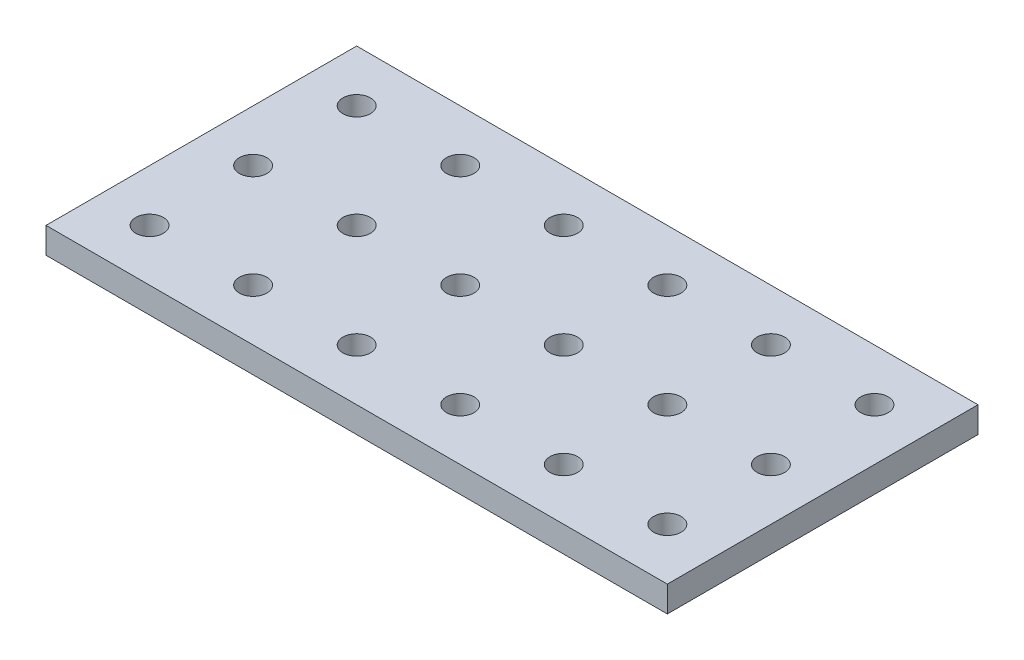
ISO-10303-21;
HEADER;
FILE_DESCRIPTION(('STEP AP214'),'2;1');
FILE_NAME('part.step','',(''),(''),'','','');
FILE_SCHEMA(('AUTOMOTIVE_DESIGN { 1 0 10303 214 1 1 1 1 }'));
ENDSEC;
DATA;
#1=APPLICATION_CONTEXT('core data for automotive mechanical design processes');
#2=APPLICATION_PROTOCOL_DEFINITION('international standard','automotive_design',2000,#1);
#3=PRODUCT_CONTEXT('',#1,'mechanical');
#4=PRODUCT('Part','Part','',(#3));
#5=PRODUCT_RELATED_PRODUCT_CATEGORY('part','',(#4));
#6=PRODUCT_DEFINITION_FORMATION('','',#4);
#7=PRODUCT_DEFINITION_CONTEXT('part definition',#1,'design');
#8=PRODUCT_DEFINITION('design','',#6,#7);
#9=PRODUCT_DEFINITION_SHAPE('','',#8);
#10=(LENGTH_UNIT() NAMED_UNIT(*) SI_UNIT(.MILLI.,.METRE.));
#11=(NAMED_UNIT(*) PLANE_ANGLE_UNIT() SI_UNIT($,.RADIAN.));
#12=(NAMED_UNIT(*) SI_UNIT($,.STERADIAN.) SOLID_ANGLE_UNIT());
#13=UNCERTAINTY_MEASURE_WITH_UNIT(LENGTH_MEASURE(1.E-05),#10,'distance_accuracy_value','');
#14=(GEOMETRIC_REPRESENTATION_CONTEXT(3) GLOBAL_UNCERTAINTY_ASSIGNED_CONTEXT((#13)) GLOBAL_UNIT_ASSIGNED_CONTEXT((#10,
#11,#12)) REPRESENTATION_CONTEXT('',''));
#15=CARTESIAN_POINT('',(0.,0.,0.));
#16=DIRECTION('',(0.,0.,1.));
#17=DIRECTION('',(1.,0.,0.));
#18=AXIS2_PLACEMENT_3D('',#15,#16,#17);
#19=CARTESIAN_POINT('',(24.9570705778385,-184.15,12.9706546052959));
#20=DIRECTION('',(-1.,0.,0.));
#21=DIRECTION('',(0.,0.,1.));
#22=AXIS2_PLACEMENT_3D('',#19,#20,#21);
#23=PLANE('',#22);
#24=DIRECTION('',(0.,0.,-1.));
#25=VECTOR('',#24,1.);
#26=CARTESIAN_POINT('',(24.9570705778385,-190.5,12.9706546052959));
#27=LINE('',#26,#25);
#28=CARTESIAN_POINT('',(24.9570705778385,-190.5,12.9706546052959));
#29=VERTEX_POINT('',#28);
#30=CARTESIAN_POINT('',(24.9570705778385,-190.5,-63.2293453947041));
#31=VERTEX_POINT('',#30);
#32=EDGE_CURVE('E96',#29,#31,#27,.T.);
#33=ORIENTED_EDGE('',*,*,#32,.T.);
#34=DIRECTION('',(0.,-1.,0.));
#35=VECTOR('',#34,1.);
#36=CARTESIAN_POINT('',(24.9570705778385,-184.15,-63.2293453947041));
#37=LINE('',#36,#35);
#38=CARTESIAN_POINT('',(24.9570705778385,-184.15,-63.2293453947041));
#39=VERTEX_POINT('',#38);
#40=EDGE_CURVE('E11',#39,#31,#37,.T.);
#41=ORIENTED_EDGE('',*,*,#40,.F.);
#42=DIRECTION('',(0.,0.,-1.));
#43=VECTOR('',#42,1.);
#44=CARTESIAN_POINT('',(24.9570705778385,-184.15,12.9706546052959));
#45=LINE('',#44,#43);
#46=CARTESIAN_POINT('',(24.9570705778385,-184.15,12.9706546052959));
#47=VERTEX_POINT('',#46);
#48=EDGE_CURVE('E84',#47,#39,#45,.T.);
#49=ORIENTED_EDGE('',*,*,#48,.F.);
#50=DIRECTION('',(0.,-1.,0.));
#51=VECTOR('',#50,1.);
#52=CARTESIAN_POINT('',(24.9570705778385,-184.15,12.9706546052959));
#53=LINE('',#52,#51);
#54=EDGE_CURVE('E92',#47,#29,#53,.T.);
#55=ORIENTED_EDGE('',*,*,#54,.T.);
#56=EDGE_LOOP('',(#33,#41,#49,#55));
#57=FACE_BOUND('',#56,.T.);
#58=ADVANCED_FACE('F33',(#57),#23,.F.);
#59=CARTESIAN_POINT('',(24.9570705778385,-184.15,-63.2293453947041));
#60=DIRECTION('',(0.,0.,1.));
#61=DIRECTION('',(1.,0.,0.));
#62=AXIS2_PLACEMENT_3D('',#59,#60,#61);
#63=PLANE('',#62);
#64=DIRECTION('',(-1.,0.,0.));
#65=VECTOR('',#64,1.);
#66=CARTESIAN_POINT('',(24.9570705778385,-190.5,-63.2293453947041));
#67=LINE('',#66,#65);
#68=CARTESIAN_POINT('',(-127.442929422161,-190.5,-63.2293453947041));
#69=VERTEX_POINT('',#68);
#70=EDGE_CURVE('E88',#31,#69,#67,.T.);
#71=ORIENTED_EDGE('',*,*,#70,.T.);
#72=DIRECTION('',(0.,-1.,0.));
#73=VECTOR('',#72,1.);
#74=CARTESIAN_POINT('',(-127.442929422161,-184.15,-63.2293453947041));
#75=LINE('',#74,#73);
#76=CARTESIAN_POINT('',(-127.442929422161,-184.15,-63.2293453947041));
#77=VERTEX_POINT('',#76);
#78=EDGE_CURVE('E41',#77,#69,#75,.T.);
#79=ORIENTED_EDGE('',*,*,#78,.F.);
#80=DIRECTION('',(-1.,0.,0.));
#81=VECTOR('',#80,1.);
#82=CARTESIAN_POINT('',(24.9570705778385,-184.15,-63.2293453947041));
#83=LINE('',#82,#81);
#84=EDGE_CURVE('E79',#39,#77,#83,.T.);
#85=ORIENTED_EDGE('',*,*,#84,.F.);
#86=ORIENTED_EDGE('',*,*,#40,.T.);
#87=EDGE_LOOP('',(#71,#79,#85,#86));
#88=FACE_BOUND('',#87,.T.);
#89=ADVANCED_FACE('F87',(#88),#63,.F.);
#90=CARTESIAN_POINT('',(-127.442929422161,-184.15,12.9706546052959));
#91=DIRECTION('',(1.,0.,0.));
#92=DIRECTION('',(0.,0.,-1.));
#93=AXIS2_PLACEMENT_3D('',#90,#91,#92);
#94=PLANE('',#93);
#95=DIRECTION('',(0.,0.,1.));
#96=VECTOR('',#95,1.);
#97=CARTESIAN_POINT('',(-127.442929422161,-190.5,12.9706546052959));
#98=LINE('',#97,#96);
#99=CARTESIAN_POINT('',(-127.442929422161,-190.5,12.9706546052959));
#100=VERTEX_POINT('',#99);
#101=EDGE_CURVE('E66',#69,#100,#98,.T.);
#102=ORIENTED_EDGE('',*,*,#101,.T.);
#103=DIRECTION('',(0.,-1.,0.));
#104=VECTOR('',#103,1.);
#105=CARTESIAN_POINT('',(-127.442929422161,-184.15,12.9706546052959));
#106=LINE('',#105,#104);
#107=CARTESIAN_POINT('',(-127.442929422161,-184.15,12.9706546052959));
#108=VERTEX_POINT('',#107);
#109=EDGE_CURVE('E89',#108,#100,#106,.T.);
#110=ORIENTED_EDGE('',*,*,#109,.F.);
#111=DIRECTION('',(0.,0.,1.));
#112=VECTOR('',#111,1.);
#113=CARTESIAN_POINT('',(-127.442929422161,-184.15,12.9706546052959));
#114=LINE('',#113,#112);
#115=EDGE_CURVE('E82',#77,#108,#114,.T.);
#116=ORIENTED_EDGE('',*,*,#115,.F.);
#117=ORIENTED_EDGE('',*,*,#78,.T.);
#118=EDGE_LOOP('',(#102,#110,#116,#117));
#119=FACE_BOUND('',#118,.T.);
#120=ADVANCED_FACE('F90',(#119),#94,.F.);
#121=CARTESIAN_POINT('',(24.9570705778385,-184.15,12.9706546052959));
#122=DIRECTION('',(0.,0.,-1.));
#123=DIRECTION('',(-1.,0.,0.));
#124=AXIS2_PLACEMENT_3D('',#121,#122,#123);
#125=PLANE('',#124);
#126=DIRECTION('',(1.,0.,0.));
#127=VECTOR('',#126,1.);
#128=CARTESIAN_POINT('',(24.9570705778385,-190.5,12.9706546052959));
#129=LINE('',#128,#127);
#130=EDGE_CURVE('E72',#100,#29,#129,.T.);
#131=ORIENTED_EDGE('',*,*,#130,.T.);
#132=ORIENTED_EDGE('',*,*,#54,.F.);
#133=DIRECTION('',(1.,0.,0.));
#134=VECTOR('',#133,1.);
#135=CARTESIAN_POINT('',(24.9570705778385,-184.15,12.9706546052959));
#136=LINE('',#135,#134);
#137=EDGE_CURVE('E49',#108,#47,#136,.T.);
#138=ORIENTED_EDGE('',*,*,#137,.F.);
#139=ORIENTED_EDGE('',*,*,#109,.T.);
#140=EDGE_LOOP('',(#131,#132,#138,#139));
#141=FACE_BOUND('',#140,.T.);
#142=ADVANCED_FACE('F104',(#141),#125,.F.);
#143=CARTESIAN_POINT('',(0.,-184.15,0.));
#144=DIRECTION('',(0.,1.,0.));
#145=DIRECTION('',(0.,0.,1.));
#146=AXIS2_PLACEMENT_3D('',#143,#144,#145);
#147=PLANE('',#146);
#148=CARTESIAN_POINT('',(-38.5429294221615,-184.15,-50.5293453947041));
#149=DIRECTION('',(0.,1.,0.));
#150=DIRECTION('',(0.,0.,1.));
#151=AXIS2_PLACEMENT_3D('',#148,#149,#150);
#152=CIRCLE('',#151,3.3782);
#153=CARTESIAN_POINT('',(-38.5429294221615,-184.15,-47.1511453947041));
#154=VERTEX_POINT('',#153);
#155=EDGE_CURVE('E214',#154,#154,#152,.T.);
#156=ORIENTED_EDGE('',*,*,#155,.F.);
#157=EDGE_LOOP('',(#156));
#158=FACE_BOUND('',#157,.T.);
#159=CARTESIAN_POINT('',(-63.9429294221615,-184.15,-50.5293453947041));
#160=DIRECTION('',(0.,1.,0.));
#161=DIRECTION('',(0.,0.,1.));
#162=AXIS2_PLACEMENT_3D('',#159,#160,#161);
#163=CIRCLE('',#162,3.3782);
#164=CARTESIAN_POINT('',(-63.9429294221615,-184.15,-47.1511453947041));
#165=VERTEX_POINT('',#164);
#166=EDGE_CURVE('E208',#165,#165,#163,.T.);
#167=ORIENTED_EDGE('',*,*,#166,.F.);
#168=EDGE_LOOP('',(#167));
#169=FACE_BOUND('',#168,.T.);
#170=CARTESIAN_POINT('',(-13.1429294221615,-184.15,-50.5293453947041));
#171=DIRECTION('',(0.,1.,0.));
#172=DIRECTION('',(0.,0.,1.));
#173=AXIS2_PLACEMENT_3D('',#170,#171,#172);
#174=CIRCLE('',#173,3.3782);
#175=CARTESIAN_POINT('',(-13.1429294221615,-184.15,-47.1511453947041));
#176=VERTEX_POINT('',#175);
#177=EDGE_CURVE('E202',#176,#176,#174,.T.);
#178=ORIENTED_EDGE('',*,*,#177,.F.);
#179=EDGE_LOOP('',(#178));
#180=FACE_BOUND('',#179,.T.);
#181=CARTESIAN_POINT('',(12.2570705778385,-184.15,-50.5293453947041));
#182=DIRECTION('',(0.,1.,0.));
#183=DIRECTION('',(0.,0.,1.));
#184=AXIS2_PLACEMENT_3D('',#181,#182,#183);
#185=CIRCLE('',#184,3.3782);
#186=CARTESIAN_POINT('',(12.2570705778385,-184.15,-47.1511453947041));
#187=VERTEX_POINT('',#186);
#188=EDGE_CURVE('E196',#187,#187,#185,.T.);
#189=ORIENTED_EDGE('',*,*,#188,.F.);
#190=EDGE_LOOP('',(#189));
#191=FACE_BOUND('',#190,.T.);
#192=CARTESIAN_POINT('',(-13.1429294221615,-184.15,-25.1293453947041));
#193=DIRECTION('',(0.,1.,0.));
#194=DIRECTION('',(0.,0.,1.));
#195=AXIS2_PLACEMENT_3D('',#192,#193,#194);
#196=CIRCLE('',#195,3.3782);
#197=CARTESIAN_POINT('',(-13.1429294221615,-184.15,-21.7511453947041));
#198=VERTEX_POINT('',#197);
#199=EDGE_CURVE('E190',#198,#198,#196,.T.);
#200=ORIENTED_EDGE('',*,*,#199,.F.);
#201=EDGE_LOOP('',(#200));
#202=FACE_BOUND('',#201,.T.);
#203=CARTESIAN_POINT('',(12.2570705778385,-184.15,-25.1293453947041));
#204=DIRECTION('',(0.,1.,0.));
#205=DIRECTION('',(0.,0.,1.));
#206=AXIS2_PLACEMENT_3D('',#203,#204,#205);
#207=CIRCLE('',#206,3.3782);
#208=CARTESIAN_POINT('',(12.2570705778385,-184.15,-21.7511453947041));
#209=VERTEX_POINT('',#208);
#210=EDGE_CURVE('E184',#209,#209,#207,.T.);
#211=ORIENTED_EDGE('',*,*,#210,.F.);
#212=EDGE_LOOP('',(#211));
#213=FACE_BOUND('',#212,.T.);
#214=CARTESIAN_POINT('',(-13.1429294221615,-184.15,0.270654605295892));
#215=DIRECTION('',(0.,1.,0.));
#216=DIRECTION('',(0.,0.,1.));
#217=AXIS2_PLACEMENT_3D('',#214,#215,#216);
#218=CIRCLE('',#217,3.3782);
#219=CARTESIAN_POINT('',(-13.1429294221615,-184.15,3.64885460529589));
#220=VERTEX_POINT('',#219);
#221=EDGE_CURVE('E178',#220,#220,#218,.T.);
#222=ORIENTED_EDGE('',*,*,#221,.F.);
#223=EDGE_LOOP('',(#222));
#224=FACE_BOUND('',#223,.T.);
#225=CARTESIAN_POINT('',(12.2570705778385,-184.15,0.270654605295892));
#226=DIRECTION('',(0.,1.,0.));
#227=DIRECTION('',(0.,0.,1.));
#228=AXIS2_PLACEMENT_3D('',#225,#226,#227);
#229=CIRCLE('',#228,3.3782);
#230=CARTESIAN_POINT('',(12.2570705778385,-184.15,3.64885460529589));
#231=VERTEX_POINT('',#230);
#232=EDGE_CURVE('E172',#231,#231,#229,.T.);
#233=ORIENTED_EDGE('',*,*,#232,.F.);
#234=EDGE_LOOP('',(#233));
#235=FACE_BOUND('',#234,.T.);
#236=CARTESIAN_POINT('',(-38.5429294221615,-184.15,-25.1293453947041));
#237=DIRECTION('',(0.,1.,0.));
#238=DIRECTION('',(0.,0.,1.));
#239=AXIS2_PLACEMENT_3D('',#236,#237,#238);
#240=CIRCLE('',#239,3.3782);
#241=CARTESIAN_POINT('',(-38.5429294221615,-184.15,-21.7511453947041));
#242=VERTEX_POINT('',#241);
#243=EDGE_CURVE('E166',#242,#242,#240,.T.);
#244=ORIENTED_EDGE('',*,*,#243,.F.);
#245=EDGE_LOOP('',(#244));
#246=FACE_BOUND('',#245,.T.);
#247=CARTESIAN_POINT('',(-38.5429294221615,-184.15,0.270654605295892));
#248=DIRECTION('',(0.,1.,0.));
#249=DIRECTION('',(0.,0.,1.));
#250=AXIS2_PLACEMENT_3D('',#247,#248,#249);
#251=CIRCLE('',#250,3.3782);
#252=CARTESIAN_POINT('',(-38.5429294221615,-184.15,3.64885460529589));
#253=VERTEX_POINT('',#252);
#254=EDGE_CURVE('E160',#253,#253,#251,.T.);
#255=ORIENTED_EDGE('',*,*,#254,.F.);
#256=EDGE_LOOP('',(#255));
#257=FACE_BOUND('',#256,.T.);
#258=CARTESIAN_POINT('',(-89.3429294221615,-184.15,-50.5293453947041));
#259=DIRECTION('',(0.,1.,0.));
#260=DIRECTION('',(0.,0.,1.));
#261=AXIS2_PLACEMENT_3D('',#258,#259,#260);
#262=CIRCLE('',#261,3.3782);
#263=CARTESIAN_POINT('',(-89.3429294221615,-184.15,-47.1511453947041));
#264=VERTEX_POINT('',#263);
#265=EDGE_CURVE('E154',#264,#264,#262,.T.);
#266=ORIENTED_EDGE('',*,*,#265,.F.);
#267=EDGE_LOOP('',(#266));
#268=FACE_BOUND('',#267,.T.);
#269=CARTESIAN_POINT('',(-114.742929422161,-184.15,-50.5293453947041));
#270=DIRECTION('',(0.,1.,0.));
#271=DIRECTION('',(0.,0.,1.));
#272=AXIS2_PLACEMENT_3D('',#269,#270,#271);
#273=CIRCLE('',#272,3.3782);
#274=CARTESIAN_POINT('',(-114.742929422161,-184.15,-47.1511453947041));
#275=VERTEX_POINT('',#274);
#276=EDGE_CURVE('E148',#275,#275,#273,.T.);
#277=ORIENTED_EDGE('',*,*,#276,.F.);
#278=EDGE_LOOP('',(#277));
#279=FACE_BOUND('',#278,.T.);
#280=CARTESIAN_POINT('',(-89.3429294221615,-184.15,-25.1293453947041));
#281=DIRECTION('',(0.,1.,0.));
#282=DIRECTION('',(0.,0.,1.));
#283=AXIS2_PLACEMENT_3D('',#280,#281,#282);
#284=CIRCLE('',#283,3.3782);
#285=CARTESIAN_POINT('',(-89.3429294221615,-184.15,-21.7511453947041));
#286=VERTEX_POINT('',#285);
#287=EDGE_CURVE('E142',#286,#286,#284,.T.);
#288=ORIENTED_EDGE('',*,*,#287,.F.);
#289=EDGE_LOOP('',(#288));
#290=FACE_BOUND('',#289,.T.);
#291=CARTESIAN_POINT('',(-114.742929422161,-184.15,-25.1293453947041));
#292=DIRECTION('',(0.,1.,0.));
#293=DIRECTION('',(0.,0.,1.));
#294=AXIS2_PLACEMENT_3D('',#291,#292,#293);
#295=CIRCLE('',#294,3.3782);
#296=CARTESIAN_POINT('',(-114.742929422161,-184.15,-21.7511453947041));
#297=VERTEX_POINT('',#296);
#298=EDGE_CURVE('E136',#297,#297,#295,.T.);
#299=ORIENTED_EDGE('',*,*,#298,.F.);
#300=EDGE_LOOP('',(#299));
#301=FACE_BOUND('',#300,.T.);
#302=CARTESIAN_POINT('',(-89.3429294221615,-184.15,0.270654605295892));
#303=DIRECTION('',(0.,1.,0.));
#304=DIRECTION('',(0.,0.,1.));
#305=AXIS2_PLACEMENT_3D('',#302,#303,#304);
#306=CIRCLE('',#305,3.3782);
#307=CARTESIAN_POINT('',(-89.3429294221615,-184.15,3.64885460529589));
#308=VERTEX_POINT('',#307);
#309=EDGE_CURVE('E130',#308,#308,#306,.T.);
#310=ORIENTED_EDGE('',*,*,#309,.F.);
#311=EDGE_LOOP('',(#310));
#312=FACE_BOUND('',#311,.T.);
#313=CARTESIAN_POINT('',(-114.742929422161,-184.15,0.270654605295899));
#314=DIRECTION('',(0.,1.,0.));
#315=DIRECTION('',(0.,0.,1.));
#316=AXIS2_PLACEMENT_3D('',#313,#314,#315);
#317=CIRCLE('',#316,3.3782);
#318=CARTESIAN_POINT('',(-114.742929422161,-184.15,3.6488546052959));
#319=VERTEX_POINT('',#318);
#320=EDGE_CURVE('E124',#319,#319,#317,.T.);
#321=ORIENTED_EDGE('',*,*,#320,.F.);
#322=EDGE_LOOP('',(#321));
#323=FACE_BOUND('',#322,.T.);
#324=CARTESIAN_POINT('',(-63.9429294221615,-184.15,-25.1293453947041));
#325=DIRECTION('',(0.,1.,0.));
#326=DIRECTION('',(0.,0.,1.));
#327=AXIS2_PLACEMENT_3D('',#324,#325,#326);
#328=CIRCLE('',#327,3.3782);
#329=CARTESIAN_POINT('',(-63.9429294221615,-184.15,-21.7511453947041));
#330=VERTEX_POINT('',#329);
#331=EDGE_CURVE('E118',#330,#330,#328,.T.);
#332=ORIENTED_EDGE('',*,*,#331,.F.);
#333=EDGE_LOOP('',(#332));
#334=FACE_BOUND('',#333,.T.);
#335=CARTESIAN_POINT('',(-63.9429294221615,-184.15,0.270654605295892));
#336=DIRECTION('',(0.,1.,0.));
#337=DIRECTION('',(0.,0.,1.));
#338=AXIS2_PLACEMENT_3D('',#335,#336,#337);
#339=CIRCLE('',#338,3.3782);
#340=CARTESIAN_POINT('',(-63.9429294221615,-184.15,3.64885460529589));
#341=VERTEX_POINT('',#340);
#342=EDGE_CURVE('E112',#341,#341,#339,.T.);
#343=ORIENTED_EDGE('',*,*,#342,.F.);
#344=EDGE_LOOP('',(#343));
#345=FACE_BOUND('',#344,.T.);
#346=ORIENTED_EDGE('',*,*,#48,.T.);
#347=ORIENTED_EDGE('',*,*,#84,.T.);
#348=ORIENTED_EDGE('',*,*,#115,.T.);
#349=ORIENTED_EDGE('',*,*,#137,.T.);
#350=EDGE_LOOP('',(#346,#347,#348,#349));
#351=FACE_BOUND('',#350,.T.);
#352=ADVANCED_FACE('F80',(#158,#169,#180,#191,#202,#213,#224,#235,#246,#257,#268,#279,#290,#301,
#312,#323,#334,#345,#351),#147,.T.);
#353=CARTESIAN_POINT('',(0.,-190.5,0.));
#354=DIRECTION('',(0.,1.,0.));
#355=DIRECTION('',(0.,0.,1.));
#356=AXIS2_PLACEMENT_3D('',#353,#354,#355);
#357=PLANE('',#356);
#358=CARTESIAN_POINT('',(-38.5429294221615,-190.5,-50.5293453947041));
#359=DIRECTION('',(0.,1.,0.));
#360=DIRECTION('',(0.,0.,1.));
#361=AXIS2_PLACEMENT_3D('',#358,#359,#360);
#362=CIRCLE('',#361,3.3782);
#363=CARTESIAN_POINT('',(-38.5429294221615,-190.5,-47.1511453947041));
#364=VERTEX_POINT('',#363);
#365=EDGE_CURVE('E211',#364,#364,#362,.T.);
#366=ORIENTED_EDGE('',*,*,#365,.T.);
#367=EDGE_LOOP('',(#366));
#368=FACE_BOUND('',#367,.T.);
#369=CARTESIAN_POINT('',(-63.9429294221615,-190.5,-50.5293453947041));
#370=DIRECTION('',(0.,1.,0.));
#371=DIRECTION('',(0.,0.,1.));
#372=AXIS2_PLACEMENT_3D('',#369,#370,#371);
#373=CIRCLE('',#372,3.3782);
#374=CARTESIAN_POINT('',(-63.9429294221615,-190.5,-47.1511453947041));
#375=VERTEX_POINT('',#374);
#376=EDGE_CURVE('E205',#375,#375,#373,.T.);
#377=ORIENTED_EDGE('',*,*,#376,.T.);
#378=EDGE_LOOP('',(#377));
#379=FACE_BOUND('',#378,.T.);
#380=CARTESIAN_POINT('',(-13.1429294221615,-190.5,-50.5293453947041));
#381=DIRECTION('',(0.,1.,0.));
#382=DIRECTION('',(0.,0.,1.));
#383=AXIS2_PLACEMENT_3D('',#380,#381,#382);
#384=CIRCLE('',#383,3.3782);
#385=CARTESIAN_POINT('',(-13.1429294221615,-190.5,-47.1511453947041));
#386=VERTEX_POINT('',#385);
#387=EDGE_CURVE('E199',#386,#386,#384,.T.);
#388=ORIENTED_EDGE('',*,*,#387,.T.);
#389=EDGE_LOOP('',(#388));
#390=FACE_BOUND('',#389,.T.);
#391=CARTESIAN_POINT('',(12.2570705778385,-190.5,-50.5293453947041));
#392=DIRECTION('',(0.,1.,0.));
#393=DIRECTION('',(0.,0.,1.));
#394=AXIS2_PLACEMENT_3D('',#391,#392,#393);
#395=CIRCLE('',#394,3.3782);
#396=CARTESIAN_POINT('',(12.2570705778385,-190.5,-47.1511453947041));
#397=VERTEX_POINT('',#396);
#398=EDGE_CURVE('E193',#397,#397,#395,.T.);
#399=ORIENTED_EDGE('',*,*,#398,.T.);
#400=EDGE_LOOP('',(#399));
#401=FACE_BOUND('',#400,.T.);
#402=CARTESIAN_POINT('',(-13.1429294221615,-190.5,-25.1293453947041));
#403=DIRECTION('',(0.,1.,0.));
#404=DIRECTION('',(0.,0.,1.));
#405=AXIS2_PLACEMENT_3D('',#402,#403,#404);
#406=CIRCLE('',#405,3.3782);
#407=CARTESIAN_POINT('',(-13.1429294221615,-190.5,-21.7511453947041));
#408=VERTEX_POINT('',#407);
#409=EDGE_CURVE('E187',#408,#408,#406,.T.);
#410=ORIENTED_EDGE('',*,*,#409,.T.);
#411=EDGE_LOOP('',(#410));
#412=FACE_BOUND('',#411,.T.);
#413=CARTESIAN_POINT('',(12.2570705778385,-190.5,-25.1293453947041));
#414=DIRECTION('',(0.,1.,0.));
#415=DIRECTION('',(0.,0.,1.));
#416=AXIS2_PLACEMENT_3D('',#413,#414,#415);
#417=CIRCLE('',#416,3.3782);
#418=CARTESIAN_POINT('',(12.2570705778385,-190.5,-21.7511453947041));
#419=VERTEX_POINT('',#418);
#420=EDGE_CURVE('E181',#419,#419,#417,.T.);
#421=ORIENTED_EDGE('',*,*,#420,.T.);
#422=EDGE_LOOP('',(#421));
#423=FACE_BOUND('',#422,.T.);
#424=CARTESIAN_POINT('',(-13.1429294221615,-190.5,0.270654605295892));
#425=DIRECTION('',(0.,1.,0.));
#426=DIRECTION('',(0.,0.,1.));
#427=AXIS2_PLACEMENT_3D('',#424,#425,#426);
#428=CIRCLE('',#427,3.3782);
#429=CARTESIAN_POINT('',(-13.1429294221615,-190.5,3.64885460529589));
#430=VERTEX_POINT('',#429);
#431=EDGE_CURVE('E175',#430,#430,#428,.T.);
#432=ORIENTED_EDGE('',*,*,#431,.T.);
#433=EDGE_LOOP('',(#432));
#434=FACE_BOUND('',#433,.T.);
#435=CARTESIAN_POINT('',(12.2570705778385,-190.5,0.270654605295892));
#436=DIRECTION('',(0.,1.,0.));
#437=DIRECTION('',(0.,0.,1.));
#438=AXIS2_PLACEMENT_3D('',#435,#436,#437);
#439=CIRCLE('',#438,3.3782);
#440=CARTESIAN_POINT('',(12.2570705778385,-190.5,3.64885460529589));
#441=VERTEX_POINT('',#440);
#442=EDGE_CURVE('E169',#441,#441,#439,.T.);
#443=ORIENTED_EDGE('',*,*,#442,.T.);
#444=EDGE_LOOP('',(#443));
#445=FACE_BOUND('',#444,.T.);
#446=CARTESIAN_POINT('',(-38.5429294221615,-190.5,-25.1293453947041));
#447=DIRECTION('',(0.,1.,0.));
#448=DIRECTION('',(0.,0.,1.));
#449=AXIS2_PLACEMENT_3D('',#446,#447,#448);
#450=CIRCLE('',#449,3.3782);
#451=CARTESIAN_POINT('',(-38.5429294221615,-190.5,-21.7511453947041));
#452=VERTEX_POINT('',#451);
#453=EDGE_CURVE('E163',#452,#452,#450,.T.);
#454=ORIENTED_EDGE('',*,*,#453,.T.);
#455=EDGE_LOOP('',(#454));
#456=FACE_BOUND('',#455,.T.);
#457=CARTESIAN_POINT('',(-38.5429294221615,-190.5,0.270654605295892));
#458=DIRECTION('',(0.,1.,0.));
#459=DIRECTION('',(0.,0.,1.));
#460=AXIS2_PLACEMENT_3D('',#457,#458,#459);
#461=CIRCLE('',#460,3.3782);
#462=CARTESIAN_POINT('',(-38.5429294221615,-190.5,3.64885460529589));
#463=VERTEX_POINT('',#462);
#464=EDGE_CURVE('E157',#463,#463,#461,.T.);
#465=ORIENTED_EDGE('',*,*,#464,.T.);
#466=EDGE_LOOP('',(#465));
#467=FACE_BOUND('',#466,.T.);
#468=CARTESIAN_POINT('',(-89.3429294221615,-190.5,-50.5293453947041));
#469=DIRECTION('',(0.,1.,0.));
#470=DIRECTION('',(0.,0.,1.));
#471=AXIS2_PLACEMENT_3D('',#468,#469,#470);
#472=CIRCLE('',#471,3.3782);
#473=CARTESIAN_POINT('',(-89.3429294221615,-190.5,-47.1511453947041));
#474=VERTEX_POINT('',#473);
#475=EDGE_CURVE('E151',#474,#474,#472,.T.);
#476=ORIENTED_EDGE('',*,*,#475,.T.);
#477=EDGE_LOOP('',(#476));
#478=FACE_BOUND('',#477,.T.);
#479=CARTESIAN_POINT('',(-114.742929422161,-190.5,-50.5293453947041));
#480=DIRECTION('',(0.,1.,0.));
#481=DIRECTION('',(0.,0.,1.));
#482=AXIS2_PLACEMENT_3D('',#479,#480,#481);
#483=CIRCLE('',#482,3.3782);
#484=CARTESIAN_POINT('',(-114.742929422161,-190.5,-47.1511453947041));
#485=VERTEX_POINT('',#484);
#486=EDGE_CURVE('E145',#485,#485,#483,.T.);
#487=ORIENTED_EDGE('',*,*,#486,.T.);
#488=EDGE_LOOP('',(#487));
#489=FACE_BOUND('',#488,.T.);
#490=CARTESIAN_POINT('',(-89.3429294221615,-190.5,-25.1293453947041));
#491=DIRECTION('',(0.,1.,0.));
#492=DIRECTION('',(0.,0.,1.));
#493=AXIS2_PLACEMENT_3D('',#490,#491,#492);
#494=CIRCLE('',#493,3.3782);
#495=CARTESIAN_POINT('',(-89.3429294221615,-190.5,-21.7511453947041));
#496=VERTEX_POINT('',#495);
#497=EDGE_CURVE('E139',#496,#496,#494,.T.);
#498=ORIENTED_EDGE('',*,*,#497,.T.);
#499=EDGE_LOOP('',(#498));
#500=FACE_BOUND('',#499,.T.);
#501=CARTESIAN_POINT('',(-114.742929422161,-190.5,-25.1293453947041));
#502=DIRECTION('',(0.,1.,0.));
#503=DIRECTION('',(0.,0.,1.));
#504=AXIS2_PLACEMENT_3D('',#501,#502,#503);
#505=CIRCLE('',#504,3.3782);
#506=CARTESIAN_POINT('',(-114.742929422161,-190.5,-21.7511453947041));
#507=VERTEX_POINT('',#506);
#508=EDGE_CURVE('E133',#507,#507,#505,.T.);
#509=ORIENTED_EDGE('',*,*,#508,.T.);
#510=EDGE_LOOP('',(#509));
#511=FACE_BOUND('',#510,.T.);
#512=CARTESIAN_POINT('',(-89.3429294221615,-190.5,0.270654605295892));
#513=DIRECTION('',(0.,1.,0.));
#514=DIRECTION('',(0.,0.,1.));
#515=AXIS2_PLACEMENT_3D('',#512,#513,#514);
#516=CIRCLE('',#515,3.3782);
#517=CARTESIAN_POINT('',(-89.3429294221615,-190.5,3.64885460529589));
#518=VERTEX_POINT('',#517);
#519=EDGE_CURVE('E127',#518,#518,#516,.T.);
#520=ORIENTED_EDGE('',*,*,#519,.T.);
#521=EDGE_LOOP('',(#520));
#522=FACE_BOUND('',#521,.T.);
#523=CARTESIAN_POINT('',(-114.742929422161,-190.5,0.270654605295899));
#524=DIRECTION('',(0.,1.,0.));
#525=DIRECTION('',(0.,0.,1.));
#526=AXIS2_PLACEMENT_3D('',#523,#524,#525);
#527=CIRCLE('',#526,3.3782);
#528=CARTESIAN_POINT('',(-114.742929422161,-190.5,3.6488546052959));
#529=VERTEX_POINT('',#528);
#530=EDGE_CURVE('E121',#529,#529,#527,.T.);
#531=ORIENTED_EDGE('',*,*,#530,.T.);
#532=EDGE_LOOP('',(#531));
#533=FACE_BOUND('',#532,.T.);
#534=CARTESIAN_POINT('',(-63.9429294221615,-190.5,-25.1293453947041));
#535=DIRECTION('',(0.,1.,0.));
#536=DIRECTION('',(0.,0.,1.));
#537=AXIS2_PLACEMENT_3D('',#534,#535,#536);
#538=CIRCLE('',#537,3.3782);
#539=CARTESIAN_POINT('',(-63.9429294221615,-190.5,-21.7511453947041));
#540=VERTEX_POINT('',#539);
#541=EDGE_CURVE('E115',#540,#540,#538,.T.);
#542=ORIENTED_EDGE('',*,*,#541,.T.);
#543=EDGE_LOOP('',(#542));
#544=FACE_BOUND('',#543,.T.);
#545=CARTESIAN_POINT('',(-63.9429294221615,-190.5,0.270654605295892));
#546=DIRECTION('',(0.,1.,0.));
#547=DIRECTION('',(0.,0.,1.));
#548=AXIS2_PLACEMENT_3D('',#545,#546,#547);
#549=CIRCLE('',#548,3.3782);
#550=CARTESIAN_POINT('',(-63.9429294221615,-190.5,3.64885460529589));
#551=VERTEX_POINT('',#550);
#552=EDGE_CURVE('E99',#551,#551,#549,.T.);
#553=ORIENTED_EDGE('',*,*,#552,.T.);
#554=EDGE_LOOP('',(#553));
#555=FACE_BOUND('',#554,.T.);
#556=ORIENTED_EDGE('',*,*,#32,.F.);
#557=ORIENTED_EDGE('',*,*,#130,.F.);
#558=ORIENTED_EDGE('',*,*,#101,.F.);
#559=ORIENTED_EDGE('',*,*,#70,.F.);
#560=EDGE_LOOP('',(#556,#557,#558,#559));
#561=FACE_BOUND('',#560,.T.);
#562=ADVANCED_FACE('F107',(#368,#379,#390,#401,#412,#423,#434,#445,#456,#467,#478,#489,#500,
#511,#522,#533,#544,#555,#561),#357,.F.);
#563=CARTESIAN_POINT('',(-63.9429294221615,-184.15,0.270654605295892));
#564=DIRECTION('',(0.,1.,0.));
#565=DIRECTION('',(0.,0.,1.));
#566=AXIS2_PLACEMENT_3D('',#563,#564,#565);
#567=CYLINDRICAL_SURFACE('',#566,3.3782);
#568=ORIENTED_EDGE('',*,*,#552,.F.);
#569=EDGE_LOOP('',(#568));
#570=FACE_BOUND('',#569,.T.);
#571=ORIENTED_EDGE('',*,*,#342,.T.);
#572=EDGE_LOOP('',(#571));
#573=FACE_BOUND('',#572,.T.);
#574=ADVANCED_FACE('F257',(#570,#573),#567,.F.);
#575=CARTESIAN_POINT('',(-63.9429294221615,-184.15,-25.1293453947041));
#576=DIRECTION('',(0.,1.,0.));
#577=DIRECTION('',(0.,0.,1.));
#578=AXIS2_PLACEMENT_3D('',#575,#576,#577);
#579=CYLINDRICAL_SURFACE('',#578,3.3782);
#580=ORIENTED_EDGE('',*,*,#541,.F.);
#581=EDGE_LOOP('',(#580));
#582=FACE_BOUND('',#581,.T.);
#583=ORIENTED_EDGE('',*,*,#331,.T.);
#584=EDGE_LOOP('',(#583));
#585=FACE_BOUND('',#584,.T.);
#586=ADVANCED_FACE('F259',(#582,#585),#579,.F.);
#587=CARTESIAN_POINT('',(-114.742929422161,-184.15,0.270654605295899));
#588=DIRECTION('',(0.,1.,0.));
#589=DIRECTION('',(0.,0.,1.));
#590=AXIS2_PLACEMENT_3D('',#587,#588,#589);
#591=CYLINDRICAL_SURFACE('',#590,3.3782);
#592=ORIENTED_EDGE('',*,*,#530,.F.);
#593=EDGE_LOOP('',(#592));
#594=FACE_BOUND('',#593,.T.);
#595=ORIENTED_EDGE('',*,*,#320,.T.);
#596=EDGE_LOOP('',(#595));
#597=FACE_BOUND('',#596,.T.);
#598=ADVANCED_FACE('F266',(#594,#597),#591,.F.);
#599=CARTESIAN_POINT('',(-89.3429294221615,-184.15,0.270654605295892));
#600=DIRECTION('',(0.,1.,0.));
#601=DIRECTION('',(0.,0.,1.));
#602=AXIS2_PLACEMENT_3D('',#599,#600,#601);
#603=CYLINDRICAL_SURFACE('',#602,3.3782);
#604=ORIENTED_EDGE('',*,*,#519,.F.);
#605=EDGE_LOOP('',(#604));
#606=FACE_BOUND('',#605,.T.);
#607=ORIENTED_EDGE('',*,*,#309,.T.);
#608=EDGE_LOOP('',(#607));
#609=FACE_BOUND('',#608,.T.);
#610=ADVANCED_FACE('F313',(#606,#609),#603,.F.);
#611=CARTESIAN_POINT('',(-114.742929422161,-184.15,-25.1293453947041));
#612=DIRECTION('',(0.,1.,0.));
#613=DIRECTION('',(0.,0.,1.));
#614=AXIS2_PLACEMENT_3D('',#611,#612,#613);
#615=CYLINDRICAL_SURFACE('',#614,3.3782);
#616=ORIENTED_EDGE('',*,*,#508,.F.);
#617=EDGE_LOOP('',(#616));
#618=FACE_BOUND('',#617,.T.);
#619=ORIENTED_EDGE('',*,*,#298,.T.);
#620=EDGE_LOOP('',(#619));
#621=FACE_BOUND('',#620,.T.);
#622=ADVANCED_FACE('F323',(#618,#621),#615,.F.);
#623=CARTESIAN_POINT('',(-89.3429294221615,-184.15,-25.1293453947041));
#624=DIRECTION('',(0.,1.,0.));
#625=DIRECTION('',(0.,0.,1.));
#626=AXIS2_PLACEMENT_3D('',#623,#624,#625);
#627=CYLINDRICAL_SURFACE('',#626,3.3782);
#628=ORIENTED_EDGE('',*,*,#497,.F.);
#629=EDGE_LOOP('',(#628));
#630=FACE_BOUND('',#629,.T.);
#631=ORIENTED_EDGE('',*,*,#287,.T.);
#632=EDGE_LOOP('',(#631));
#633=FACE_BOUND('',#632,.T.);
#634=ADVANCED_FACE('F333',(#630,#633),#627,.F.);
#635=CARTESIAN_POINT('',(-114.742929422161,-184.15,-50.5293453947041));
#636=DIRECTION('',(0.,1.,0.));
#637=DIRECTION('',(0.,0.,1.));
#638=AXIS2_PLACEMENT_3D('',#635,#636,#637);
#639=CYLINDRICAL_SURFACE('',#638,3.3782);
#640=ORIENTED_EDGE('',*,*,#486,.F.);
#641=EDGE_LOOP('',(#640));
#642=FACE_BOUND('',#641,.T.);
#643=ORIENTED_EDGE('',*,*,#276,.T.);
#644=EDGE_LOOP('',(#643));
#645=FACE_BOUND('',#644,.T.);
#646=ADVANCED_FACE('F343',(#642,#645),#639,.F.);
#647=CARTESIAN_POINT('',(-89.3429294221615,-184.15,-50.5293453947041));
#648=DIRECTION('',(0.,1.,0.));
#649=DIRECTION('',(0.,0.,1.));
#650=AXIS2_PLACEMENT_3D('',#647,#648,#649);
#651=CYLINDRICAL_SURFACE('',#650,3.3782);
#652=ORIENTED_EDGE('',*,*,#475,.F.);
#653=EDGE_LOOP('',(#652));
#654=FACE_BOUND('',#653,.T.);
#655=ORIENTED_EDGE('',*,*,#265,.T.);
#656=EDGE_LOOP('',(#655));
#657=FACE_BOUND('',#656,.T.);
#658=ADVANCED_FACE('F353',(#654,#657),#651,.F.);
#659=CARTESIAN_POINT('',(-38.5429294221615,-184.15,0.270654605295892));
#660=DIRECTION('',(0.,1.,0.));
#661=DIRECTION('',(0.,0.,1.));
#662=AXIS2_PLACEMENT_3D('',#659,#660,#661);
#663=CYLINDRICAL_SURFACE('',#662,3.3782);
#664=ORIENTED_EDGE('',*,*,#464,.F.);
#665=EDGE_LOOP('',(#664));
#666=FACE_BOUND('',#665,.T.);
#667=ORIENTED_EDGE('',*,*,#254,.T.);
#668=EDGE_LOOP('',(#667));
#669=FACE_BOUND('',#668,.T.);
#670=ADVANCED_FACE('F363',(#666,#669),#663,.F.);
#671=CARTESIAN_POINT('',(-38.5429294221615,-184.15,-25.1293453947041));
#672=DIRECTION('',(0.,1.,0.));
#673=DIRECTION('',(0.,0.,1.));
#674=AXIS2_PLACEMENT_3D('',#671,#672,#673);
#675=CYLINDRICAL_SURFACE('',#674,3.3782);
#676=ORIENTED_EDGE('',*,*,#453,.F.);
#677=EDGE_LOOP('',(#676));
#678=FACE_BOUND('',#677,.T.);
#679=ORIENTED_EDGE('',*,*,#243,.T.);
#680=EDGE_LOOP('',(#679));
#681=FACE_BOUND('',#680,.T.);
#682=ADVANCED_FACE('F373',(#678,#681),#675,.F.);
#683=CARTESIAN_POINT('',(12.2570705778385,-184.15,0.270654605295892));
#684=DIRECTION('',(0.,1.,0.));
#685=DIRECTION('',(0.,0.,1.));
#686=AXIS2_PLACEMENT_3D('',#683,#684,#685);
#687=CYLINDRICAL_SURFACE('',#686,3.3782);
#688=ORIENTED_EDGE('',*,*,#442,.F.);
#689=EDGE_LOOP('',(#688));
#690=FACE_BOUND('',#689,.T.);
#691=ORIENTED_EDGE('',*,*,#232,.T.);
#692=EDGE_LOOP('',(#691));
#693=FACE_BOUND('',#692,.T.);
#694=ADVANCED_FACE('F383',(#690,#693),#687,.F.);
#695=CARTESIAN_POINT('',(-13.1429294221615,-184.15,0.270654605295892));
#696=DIRECTION('',(0.,1.,0.));
#697=DIRECTION('',(0.,0.,1.));
#698=AXIS2_PLACEMENT_3D('',#695,#696,#697);
#699=CYLINDRICAL_SURFACE('',#698,3.3782);
#700=ORIENTED_EDGE('',*,*,#431,.F.);
#701=EDGE_LOOP('',(#700));
#702=FACE_BOUND('',#701,.T.);
#703=ORIENTED_EDGE('',*,*,#221,.T.);
#704=EDGE_LOOP('',(#703));
#705=FACE_BOUND('',#704,.T.);
#706=ADVANCED_FACE('F393',(#702,#705),#699,.F.);
#707=CARTESIAN_POINT('',(12.2570705778385,-184.15,-25.1293453947041));
#708=DIRECTION('',(0.,1.,0.));
#709=DIRECTION('',(0.,0.,1.));
#710=AXIS2_PLACEMENT_3D('',#707,#708,#709);
#711=CYLINDRICAL_SURFACE('',#710,3.3782);
#712=ORIENTED_EDGE('',*,*,#420,.F.);
#713=EDGE_LOOP('',(#712));
#714=FACE_BOUND('',#713,.T.);
#715=ORIENTED_EDGE('',*,*,#210,.T.);
#716=EDGE_LOOP('',(#715));
#717=FACE_BOUND('',#716,.T.);
#718=ADVANCED_FACE('F403',(#714,#717),#711,.F.);
#719=CARTESIAN_POINT('',(-13.1429294221615,-184.15,-25.1293453947041));
#720=DIRECTION('',(0.,1.,0.));
#721=DIRECTION('',(0.,0.,1.));
#722=AXIS2_PLACEMENT_3D('',#719,#720,#721);
#723=CYLINDRICAL_SURFACE('',#722,3.3782);
#724=ORIENTED_EDGE('',*,*,#409,.F.);
#725=EDGE_LOOP('',(#724));
#726=FACE_BOUND('',#725,.T.);
#727=ORIENTED_EDGE('',*,*,#199,.T.);
#728=EDGE_LOOP('',(#727));
#729=FACE_BOUND('',#728,.T.);
#730=ADVANCED_FACE('F413',(#726,#729),#723,.F.);
#731=CARTESIAN_POINT('',(12.2570705778385,-184.15,-50.5293453947041));
#732=DIRECTION('',(0.,1.,0.));
#733=DIRECTION('',(0.,0.,1.));
#734=AXIS2_PLACEMENT_3D('',#731,#732,#733);
#735=CYLINDRICAL_SURFACE('',#734,3.3782);
#736=ORIENTED_EDGE('',*,*,#398,.F.);
#737=EDGE_LOOP('',(#736));
#738=FACE_BOUND('',#737,.T.);
#739=ORIENTED_EDGE('',*,*,#188,.T.);
#740=EDGE_LOOP('',(#739));
#741=FACE_BOUND('',#740,.T.);
#742=ADVANCED_FACE('F423',(#738,#741),#735,.F.);
#743=CARTESIAN_POINT('',(-13.1429294221615,-184.15,-50.5293453947041));
#744=DIRECTION('',(0.,1.,0.));
#745=DIRECTION('',(0.,0.,1.));
#746=AXIS2_PLACEMENT_3D('',#743,#744,#745);
#747=CYLINDRICAL_SURFACE('',#746,3.3782);
#748=ORIENTED_EDGE('',*,*,#387,.F.);
#749=EDGE_LOOP('',(#748));
#750=FACE_BOUND('',#749,.T.);
#751=ORIENTED_EDGE('',*,*,#177,.T.);
#752=EDGE_LOOP('',(#751));
#753=FACE_BOUND('',#752,.T.);
#754=ADVANCED_FACE('F433',(#750,#753),#747,.F.);
#755=CARTESIAN_POINT('',(-63.9429294221615,-184.15,-50.5293453947041));
#756=DIRECTION('',(0.,1.,0.));
#757=DIRECTION('',(0.,0.,1.));
#758=AXIS2_PLACEMENT_3D('',#755,#756,#757);
#759=CYLINDRICAL_SURFACE('',#758,3.3782);
#760=ORIENTED_EDGE('',*,*,#376,.F.);
#761=EDGE_LOOP('',(#760));
#762=FACE_BOUND('',#761,.T.);
#763=ORIENTED_EDGE('',*,*,#166,.T.);
#764=EDGE_LOOP('',(#763));
#765=FACE_BOUND('',#764,.T.);
#766=ADVANCED_FACE('F443',(#762,#765),#759,.F.);
#767=CARTESIAN_POINT('',(-38.5429294221615,-184.15,-50.5293453947041));
#768=DIRECTION('',(0.,1.,0.));
#769=DIRECTION('',(0.,0.,1.));
#770=AXIS2_PLACEMENT_3D('',#767,#768,#769);
#771=CYLINDRICAL_SURFACE('',#770,3.3782);
#772=ORIENTED_EDGE('',*,*,#365,.F.);
#773=EDGE_LOOP('',(#772));
#774=FACE_BOUND('',#773,.T.);
#775=ORIENTED_EDGE('',*,*,#155,.T.);
#776=EDGE_LOOP('',(#775));
#777=FACE_BOUND('',#776,.T.);
#778=ADVANCED_FACE('F218',(#774,#777),#771,.F.);
#779=CLOSED_SHELL('',(#58,#89,#120,#142,#352,#562,#574,#586,#598,#610,#622,#634,#646,#658,#670,
#682,#694,#706,#718,#730,#742,#754,#766,#778));
#780=MANIFOLD_SOLID_BREP('B2',#779);
#781=ADVANCED_BREP_SHAPE_REPRESENTATION('',(#18,#780),#14);
#782=SHAPE_DEFINITION_REPRESENTATION(#9,#781);
ENDSEC;
END-ISO-10303-21;
